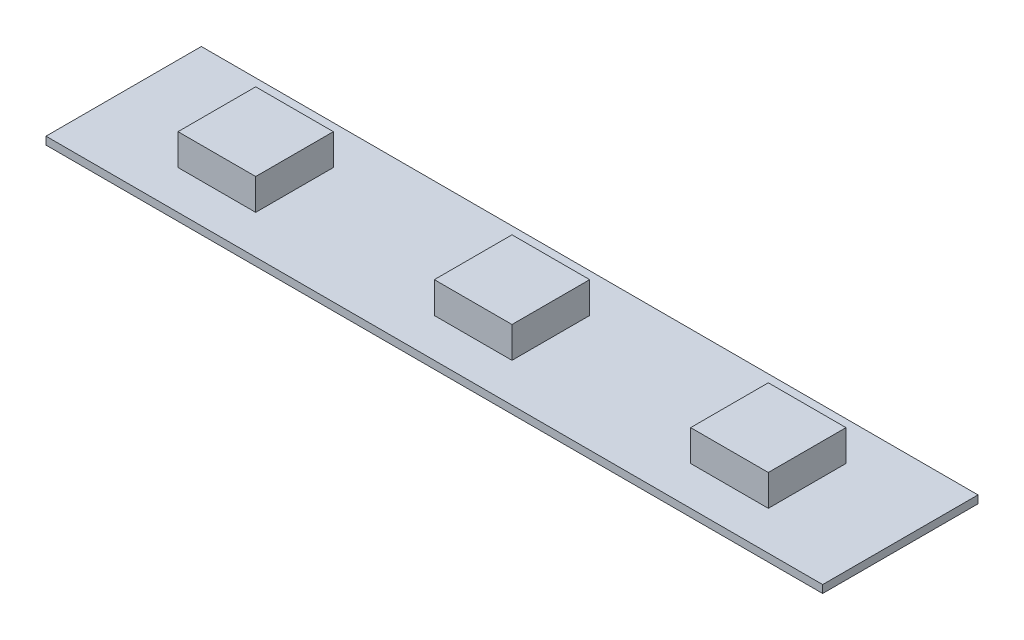
ISO-10303-21;
HEADER;
FILE_DESCRIPTION(('STEP AP214'),'2;1');
FILE_NAME('part.step','',(''),(''),'','','');
FILE_SCHEMA(('AUTOMOTIVE_DESIGN { 1 0 10303 214 1 1 1 1 }'));
ENDSEC;
DATA;
#1=APPLICATION_CONTEXT('core data for automotive mechanical design processes');
#2=APPLICATION_PROTOCOL_DEFINITION('international standard','automotive_design',2000,#1);
#3=PRODUCT_CONTEXT('',#1,'mechanical');
#4=PRODUCT('Part','Part','',(#3));
#5=PRODUCT_RELATED_PRODUCT_CATEGORY('part','',(#4));
#6=PRODUCT_DEFINITION_FORMATION('','',#4);
#7=PRODUCT_DEFINITION_CONTEXT('part definition',#1,'design');
#8=PRODUCT_DEFINITION('design','',#6,#7);
#9=PRODUCT_DEFINITION_SHAPE('','',#8);
#10=(LENGTH_UNIT() NAMED_UNIT(*) SI_UNIT(.MILLI.,.METRE.));
#11=(NAMED_UNIT(*) PLANE_ANGLE_UNIT() SI_UNIT($,.RADIAN.));
#12=(NAMED_UNIT(*) SI_UNIT($,.STERADIAN.) SOLID_ANGLE_UNIT());
#13=UNCERTAINTY_MEASURE_WITH_UNIT(LENGTH_MEASURE(1.E-05),#10,'distance_accuracy_value','');
#14=(GEOMETRIC_REPRESENTATION_CONTEXT(3) GLOBAL_UNCERTAINTY_ASSIGNED_CONTEXT((#13)) GLOBAL_UNIT_ASSIGNED_CONTEXT((#10,
#11,#12)) REPRESENTATION_CONTEXT('',''));
#15=CARTESIAN_POINT('',(0.,0.,0.));
#16=DIRECTION('',(0.,0.,1.));
#17=DIRECTION('',(1.,0.,0.));
#18=AXIS2_PLACEMENT_3D('',#15,#16,#17);
#19=CARTESIAN_POINT('',(0.,0.5,0.));
#20=DIRECTION('',(0.,-1.,0.));
#21=DIRECTION('',(0.,0.,-1.));
#22=AXIS2_PLACEMENT_3D('',#19,#20,#21);
#23=PLANE('',#22);
#24=DIRECTION('',(0.,0.,-1.));
#25=VECTOR('',#24,1.);
#26=CARTESIAN_POINT('',(2.5,0.5,2.5));
#27=LINE('',#26,#25);
#28=CARTESIAN_POINT('',(2.5,0.5,2.5));
#29=VERTEX_POINT('',#28);
#30=CARTESIAN_POINT('',(2.5,0.5,-2.5));
#31=VERTEX_POINT('',#30);
#32=EDGE_CURVE('E180',#29,#31,#27,.T.);
#33=ORIENTED_EDGE('',*,*,#32,.F.);
#34=DIRECTION('',(1.,0.,0.));
#35=VECTOR('',#34,1.);
#36=CARTESIAN_POINT('',(-2.5,0.5,2.5));
#37=LINE('',#36,#35);
#38=CARTESIAN_POINT('',(-2.5,0.5,2.5));
#39=VERTEX_POINT('',#38);
#40=EDGE_CURVE('E196',#39,#29,#37,.T.);
#41=ORIENTED_EDGE('',*,*,#40,.F.);
#42=DIRECTION('',(0.,0.,1.));
#43=VECTOR('',#42,1.);
#44=CARTESIAN_POINT('',(-2.5,0.5,2.5));
#45=LINE('',#44,#43);
#46=CARTESIAN_POINT('',(-2.5,0.5,-2.5));
#47=VERTEX_POINT('',#46);
#48=EDGE_CURVE('E209',#47,#39,#45,.T.);
#49=ORIENTED_EDGE('',*,*,#48,.F.);
#50=DIRECTION('',(-1.,0.,0.));
#51=VECTOR('',#50,1.);
#52=CARTESIAN_POINT('',(-2.5,0.5,-2.5));
#53=LINE('',#52,#51);
#54=EDGE_CURVE('E185',#31,#47,#53,.T.);
#55=ORIENTED_EDGE('',*,*,#54,.F.);
#56=EDGE_LOOP('',(#33,#41,#49,#55));
#57=FACE_BOUND('',#56,.T.);
#58=DIRECTION('',(0.,0.,-1.));
#59=VECTOR('',#58,1.);
#60=CARTESIAN_POINT('',(25.,0.5,5.));
#61=LINE('',#60,#59);
#62=CARTESIAN_POINT('',(25.,0.5,5.));
#63=VERTEX_POINT('',#62);
#64=CARTESIAN_POINT('',(25.,0.5,-5.));
#65=VERTEX_POINT('',#64);
#66=EDGE_CURVE('E277',#63,#65,#61,.T.);
#67=ORIENTED_EDGE('',*,*,#66,.T.);
#68=DIRECTION('',(-1.,0.,0.));
#69=VECTOR('',#68,1.);
#70=CARTESIAN_POINT('',(-25.,0.5,-5.));
#71=LINE('',#70,#69);
#72=CARTESIAN_POINT('',(-25.,0.5,-5.));
#73=VERTEX_POINT('',#72);
#74=EDGE_CURVE('E281',#65,#73,#71,.T.);
#75=ORIENTED_EDGE('',*,*,#74,.T.);
#76=DIRECTION('',(0.,0.,1.));
#77=VECTOR('',#76,1.);
#78=CARTESIAN_POINT('',(-25.,0.5,5.));
#79=LINE('',#78,#77);
#80=CARTESIAN_POINT('',(-25.,0.5,5.));
#81=VERTEX_POINT('',#80);
#82=EDGE_CURVE('E285',#73,#81,#79,.T.);
#83=ORIENTED_EDGE('',*,*,#82,.T.);
#84=DIRECTION('',(1.,0.,0.));
#85=VECTOR('',#84,1.);
#86=CARTESIAN_POINT('',(-25.,0.5,5.));
#87=LINE('',#86,#85);
#88=EDGE_CURVE('E288',#81,#63,#87,.T.);
#89=ORIENTED_EDGE('',*,*,#88,.T.);
#90=EDGE_LOOP('',(#67,#75,#83,#89));
#91=FACE_BOUND('',#90,.T.);
#92=DIRECTION('',(0.,0.,-1.));
#93=VECTOR('',#92,1.);
#94=CARTESIAN_POINT('',(-14.0006382669834,0.5,2.5));
#95=LINE('',#94,#93);
#96=CARTESIAN_POINT('',(-14.0006382669834,0.5,2.5));
#97=VERTEX_POINT('',#96);
#98=CARTESIAN_POINT('',(-14.0006382669834,0.5,-2.5));
#99=VERTEX_POINT('',#98);
#100=EDGE_CURVE('E231',#97,#99,#95,.T.);
#101=ORIENTED_EDGE('',*,*,#100,.F.);
#102=DIRECTION('',(1.,0.,0.));
#103=VECTOR('',#102,1.);
#104=CARTESIAN_POINT('',(-19.0006382669834,0.5,2.5));
#105=LINE('',#104,#103);
#106=CARTESIAN_POINT('',(-19.0006382669834,0.5,2.5));
#107=VERTEX_POINT('',#106);
#108=EDGE_CURVE('E237',#107,#97,#105,.T.);
#109=ORIENTED_EDGE('',*,*,#108,.F.);
#110=DIRECTION('',(0.,0.,1.));
#111=VECTOR('',#110,1.);
#112=CARTESIAN_POINT('',(-19.0006382669834,0.5,2.5));
#113=LINE('',#112,#111);
#114=CARTESIAN_POINT('',(-19.0006382669834,0.5,-2.5));
#115=VERTEX_POINT('',#114);
#116=EDGE_CURVE('E254',#115,#107,#113,.T.);
#117=ORIENTED_EDGE('',*,*,#116,.F.);
#118=DIRECTION('',(-1.,0.,0.));
#119=VECTOR('',#118,1.);
#120=CARTESIAN_POINT('',(-19.0006382669834,0.5,-2.5));
#121=LINE('',#120,#119);
#122=EDGE_CURVE('E250',#99,#115,#121,.T.);
#123=ORIENTED_EDGE('',*,*,#122,.F.);
#124=EDGE_LOOP('',(#101,#109,#117,#123));
#125=FACE_BOUND('',#124,.T.);
#126=DIRECTION('',(0.,0.,1.));
#127=VECTOR('',#126,1.);
#128=CARTESIAN_POINT('',(14.0006382669833,0.5,2.5));
#129=LINE('',#128,#127);
#130=CARTESIAN_POINT('',(14.0006382669833,0.5,-2.5));
#131=VERTEX_POINT('',#130);
#132=CARTESIAN_POINT('',(14.0006382669833,0.5,2.5));
#133=VERTEX_POINT('',#132);
#134=EDGE_CURVE('E178',#131,#133,#129,.T.);
#135=ORIENTED_EDGE('',*,*,#134,.F.);
#136=DIRECTION('',(-1.,0.,0.));
#137=VECTOR('',#136,1.);
#138=CARTESIAN_POINT('',(19.0006382669833,0.5,-2.5));
#139=LINE('',#138,#137);
#140=CARTESIAN_POINT('',(19.0006382669833,0.5,-2.5));
#141=VERTEX_POINT('',#140);
#142=EDGE_CURVE('E175',#141,#131,#139,.T.);
#143=ORIENTED_EDGE('',*,*,#142,.F.);
#144=DIRECTION('',(0.,0.,-1.));
#145=VECTOR('',#144,1.);
#146=CARTESIAN_POINT('',(19.0006382669833,0.5,2.5));
#147=LINE('',#146,#145);
#148=CARTESIAN_POINT('',(19.0006382669833,0.5,2.5));
#149=VERTEX_POINT('',#148);
#150=EDGE_CURVE('E63',#149,#141,#147,.T.);
#151=ORIENTED_EDGE('',*,*,#150,.F.);
#152=DIRECTION('',(1.,0.,0.));
#153=VECTOR('',#152,1.);
#154=CARTESIAN_POINT('',(19.0006382669833,0.5,2.5));
#155=LINE('',#154,#153);
#156=EDGE_CURVE('E58',#133,#149,#155,.T.);
#157=ORIENTED_EDGE('',*,*,#156,.F.);
#158=EDGE_LOOP('',(#135,#143,#151,#157));
#159=FACE_BOUND('',#158,.T.);
#160=ADVANCED_FACE('F42',(#57,#91,#125,#159),#23,.F.);
#161=CARTESIAN_POINT('',(25.,0.5,5.));
#162=DIRECTION('',(-1.,0.,0.));
#163=DIRECTION('',(0.,0.,1.));
#164=AXIS2_PLACEMENT_3D('',#161,#162,#163);
#165=PLANE('',#164);
#166=DIRECTION('',(0.,0.,-1.));
#167=VECTOR('',#166,1.);
#168=CARTESIAN_POINT('',(25.,0.,5.));
#169=LINE('',#168,#167);
#170=CARTESIAN_POINT('',(25.,0.,5.));
#171=VERTEX_POINT('',#170);
#172=CARTESIAN_POINT('',(25.,0.,-5.));
#173=VERTEX_POINT('',#172);
#174=EDGE_CURVE('E276',#171,#173,#169,.T.);
#175=ORIENTED_EDGE('',*,*,#174,.T.);
#176=DIRECTION('',(0.,-1.,0.));
#177=VECTOR('',#176,1.);
#178=CARTESIAN_POINT('',(25.,0.5,-5.));
#179=LINE('',#178,#177);
#180=EDGE_CURVE('E11',#65,#173,#179,.T.);
#181=ORIENTED_EDGE('',*,*,#180,.F.);
#182=ORIENTED_EDGE('',*,*,#66,.F.);
#183=DIRECTION('',(0.,-1.,0.));
#184=VECTOR('',#183,1.);
#185=CARTESIAN_POINT('',(25.,0.5,5.));
#186=LINE('',#185,#184);
#187=EDGE_CURVE('E291',#63,#171,#186,.T.);
#188=ORIENTED_EDGE('',*,*,#187,.T.);
#189=EDGE_LOOP('',(#175,#181,#182,#188));
#190=FACE_BOUND('',#189,.T.);
#191=ADVANCED_FACE('F44',(#190),#165,.F.);
#192=CARTESIAN_POINT('',(-25.,0.5,-5.));
#193=DIRECTION('',(0.,0.,1.));
#194=DIRECTION('',(1.,0.,0.));
#195=AXIS2_PLACEMENT_3D('',#192,#193,#194);
#196=PLANE('',#195);
#197=DIRECTION('',(-1.,0.,0.));
#198=VECTOR('',#197,1.);
#199=CARTESIAN_POINT('',(-25.,0.,-5.));
#200=LINE('',#199,#198);
#201=CARTESIAN_POINT('',(-25.,0.,-5.));
#202=VERTEX_POINT('',#201);
#203=EDGE_CURVE('E295',#173,#202,#200,.T.);
#204=ORIENTED_EDGE('',*,*,#203,.T.);
#205=DIRECTION('',(0.,-1.,0.));
#206=VECTOR('',#205,1.);
#207=CARTESIAN_POINT('',(-25.,0.5,-5.));
#208=LINE('',#207,#206);
#209=EDGE_CURVE('E51',#73,#202,#208,.T.);
#210=ORIENTED_EDGE('',*,*,#209,.F.);
#211=ORIENTED_EDGE('',*,*,#74,.F.);
#212=ORIENTED_EDGE('',*,*,#180,.T.);
#213=EDGE_LOOP('',(#204,#210,#211,#212));
#214=FACE_BOUND('',#213,.T.);
#215=ADVANCED_FACE('F331',(#214),#196,.F.);
#216=CARTESIAN_POINT('',(-25.,0.5,5.));
#217=DIRECTION('',(1.,0.,0.));
#218=DIRECTION('',(0.,0.,-1.));
#219=AXIS2_PLACEMENT_3D('',#216,#217,#218);
#220=PLANE('',#219);
#221=DIRECTION('',(0.,0.,1.));
#222=VECTOR('',#221,1.);
#223=CARTESIAN_POINT('',(-25.,0.,5.));
#224=LINE('',#223,#222);
#225=CARTESIAN_POINT('',(-25.,0.,5.));
#226=VERTEX_POINT('',#225);
#227=EDGE_CURVE('E298',#202,#226,#224,.T.);
#228=ORIENTED_EDGE('',*,*,#227,.T.);
#229=DIRECTION('',(0.,-1.,0.));
#230=VECTOR('',#229,1.);
#231=CARTESIAN_POINT('',(-25.,0.5,5.));
#232=LINE('',#231,#230);
#233=EDGE_CURVE('E306',#81,#226,#232,.T.);
#234=ORIENTED_EDGE('',*,*,#233,.F.);
#235=ORIENTED_EDGE('',*,*,#82,.F.);
#236=ORIENTED_EDGE('',*,*,#209,.T.);
#237=EDGE_LOOP('',(#228,#234,#235,#236));
#238=FACE_BOUND('',#237,.T.);
#239=ADVANCED_FACE('F315',(#238),#220,.F.);
#240=CARTESIAN_POINT('',(-25.,0.5,5.));
#241=DIRECTION('',(0.,0.,-1.));
#242=DIRECTION('',(-1.,0.,0.));
#243=AXIS2_PLACEMENT_3D('',#240,#241,#242);
#244=PLANE('',#243);
#245=DIRECTION('',(1.,0.,0.));
#246=VECTOR('',#245,1.);
#247=CARTESIAN_POINT('',(-25.,0.,5.));
#248=LINE('',#247,#246);
#249=EDGE_CURVE('E282',#226,#171,#248,.T.);
#250=ORIENTED_EDGE('',*,*,#249,.T.);
#251=ORIENTED_EDGE('',*,*,#187,.F.);
#252=ORIENTED_EDGE('',*,*,#88,.F.);
#253=ORIENTED_EDGE('',*,*,#233,.T.);
#254=EDGE_LOOP('',(#250,#251,#252,#253));
#255=FACE_BOUND('',#254,.T.);
#256=ADVANCED_FACE('F324',(#255),#244,.F.);
#257=CARTESIAN_POINT('',(0.,0.,0.));
#258=DIRECTION('',(0.,-1.,0.));
#259=DIRECTION('',(0.,0.,-1.));
#260=AXIS2_PLACEMENT_3D('',#257,#258,#259);
#261=PLANE('',#260);
#262=ORIENTED_EDGE('',*,*,#174,.F.);
#263=ORIENTED_EDGE('',*,*,#249,.F.);
#264=ORIENTED_EDGE('',*,*,#227,.F.);
#265=ORIENTED_EDGE('',*,*,#203,.F.);
#266=EDGE_LOOP('',(#262,#263,#264,#265));
#267=FACE_BOUND('',#266,.T.);
#268=ADVANCED_FACE('F321',(#267),#261,.T.);
#269=CARTESIAN_POINT('',(-14.0006382669834,2.5,2.5));
#270=DIRECTION('',(-1.,0.,0.));
#271=DIRECTION('',(0.,0.,1.));
#272=AXIS2_PLACEMENT_3D('',#269,#270,#271);
#273=PLANE('',#272);
#274=ORIENTED_EDGE('',*,*,#100,.T.);
#275=DIRECTION('',(0.,-1.,0.));
#276=VECTOR('',#275,1.);
#277=CARTESIAN_POINT('',(-14.0006382669834,2.5,-2.5));
#278=LINE('',#277,#276);
#279=CARTESIAN_POINT('',(-14.0006382669834,2.5,-2.5));
#280=VERTEX_POINT('',#279);
#281=EDGE_CURVE('E272',#280,#99,#278,.T.);
#282=ORIENTED_EDGE('',*,*,#281,.F.);
#283=DIRECTION('',(0.,0.,-1.));
#284=VECTOR('',#283,1.);
#285=CARTESIAN_POINT('',(-14.0006382669834,2.5,2.5));
#286=LINE('',#285,#284);
#287=CARTESIAN_POINT('',(-14.0006382669834,2.5,2.5));
#288=VERTEX_POINT('',#287);
#289=EDGE_CURVE('E232',#288,#280,#286,.T.);
#290=ORIENTED_EDGE('',*,*,#289,.F.);
#291=DIRECTION('',(0.,-1.,0.));
#292=VECTOR('',#291,1.);
#293=CARTESIAN_POINT('',(-14.0006382669834,2.5,2.5));
#294=LINE('',#293,#292);
#295=EDGE_CURVE('E246',#288,#97,#294,.T.);
#296=ORIENTED_EDGE('',*,*,#295,.T.);
#297=EDGE_LOOP('',(#274,#282,#290,#296));
#298=FACE_BOUND('',#297,.T.);
#299=ADVANCED_FACE('F345',(#298),#273,.F.);
#300=CARTESIAN_POINT('',(-19.0006382669834,2.5,-2.5));
#301=DIRECTION('',(0.,0.,1.));
#302=DIRECTION('',(1.,0.,0.));
#303=AXIS2_PLACEMENT_3D('',#300,#301,#302);
#304=PLANE('',#303);
#305=ORIENTED_EDGE('',*,*,#122,.T.);
#306=DIRECTION('',(0.,-1.,0.));
#307=VECTOR('',#306,1.);
#308=CARTESIAN_POINT('',(-19.0006382669834,2.5,-2.5));
#309=LINE('',#308,#307);
#310=CARTESIAN_POINT('',(-19.0006382669834,2.5,-2.5));
#311=VERTEX_POINT('',#310);
#312=EDGE_CURVE('E268',#311,#115,#309,.T.);
#313=ORIENTED_EDGE('',*,*,#312,.F.);
#314=DIRECTION('',(-1.,0.,0.));
#315=VECTOR('',#314,1.);
#316=CARTESIAN_POINT('',(-19.0006382669834,2.5,-2.5));
#317=LINE('',#316,#315);
#318=EDGE_CURVE('E236',#280,#311,#317,.T.);
#319=ORIENTED_EDGE('',*,*,#318,.F.);
#320=ORIENTED_EDGE('',*,*,#281,.T.);
#321=EDGE_LOOP('',(#305,#313,#319,#320));
#322=FACE_BOUND('',#321,.T.);
#323=ADVANCED_FACE('F364',(#322),#304,.F.);
#324=CARTESIAN_POINT('',(-19.0006382669834,2.5,2.5));
#325=DIRECTION('',(1.,0.,0.));
#326=DIRECTION('',(0.,0.,-1.));
#327=AXIS2_PLACEMENT_3D('',#324,#325,#326);
#328=PLANE('',#327);
#329=ORIENTED_EDGE('',*,*,#116,.T.);
#330=DIRECTION('',(0.,-1.,0.));
#331=VECTOR('',#330,1.);
#332=CARTESIAN_POINT('',(-19.0006382669834,2.5,2.5));
#333=LINE('',#332,#331);
#334=CARTESIAN_POINT('',(-19.0006382669834,2.5,2.5));
#335=VERTEX_POINT('',#334);
#336=EDGE_CURVE('E264',#335,#107,#333,.T.);
#337=ORIENTED_EDGE('',*,*,#336,.F.);
#338=DIRECTION('',(0.,0.,1.));
#339=VECTOR('',#338,1.);
#340=CARTESIAN_POINT('',(-19.0006382669834,2.5,2.5));
#341=LINE('',#340,#339);
#342=EDGE_CURVE('E240',#311,#335,#341,.T.);
#343=ORIENTED_EDGE('',*,*,#342,.F.);
#344=ORIENTED_EDGE('',*,*,#312,.T.);
#345=EDGE_LOOP('',(#329,#337,#343,#344));
#346=FACE_BOUND('',#345,.T.);
#347=ADVANCED_FACE('F371',(#346),#328,.F.);
#348=CARTESIAN_POINT('',(-19.0006382669834,2.5,2.5));
#349=DIRECTION('',(0.,0.,-1.));
#350=DIRECTION('',(-1.,0.,0.));
#351=AXIS2_PLACEMENT_3D('',#348,#349,#350);
#352=PLANE('',#351);
#353=ORIENTED_EDGE('',*,*,#108,.T.);
#354=ORIENTED_EDGE('',*,*,#295,.F.);
#355=DIRECTION('',(1.,0.,0.));
#356=VECTOR('',#355,1.);
#357=CARTESIAN_POINT('',(-19.0006382669834,2.5,2.5));
#358=LINE('',#357,#356);
#359=EDGE_CURVE('E243',#335,#288,#358,.T.);
#360=ORIENTED_EDGE('',*,*,#359,.F.);
#361=ORIENTED_EDGE('',*,*,#336,.T.);
#362=EDGE_LOOP('',(#353,#354,#360,#361));
#363=FACE_BOUND('',#362,.T.);
#364=ADVANCED_FACE('F378',(#363),#352,.F.);
#365=CARTESIAN_POINT('',(0.,2.5,0.));
#366=DIRECTION('',(0.,-1.,0.));
#367=DIRECTION('',(0.,0.,-1.));
#368=AXIS2_PLACEMENT_3D('',#365,#366,#367);
#369=PLANE('',#368);
#370=ORIENTED_EDGE('',*,*,#289,.T.);
#371=ORIENTED_EDGE('',*,*,#318,.T.);
#372=ORIENTED_EDGE('',*,*,#342,.T.);
#373=ORIENTED_EDGE('',*,*,#359,.T.);
#374=EDGE_LOOP('',(#370,#371,#372,#373));
#375=FACE_BOUND('',#374,.T.);
#376=ADVANCED_FACE('F386',(#375),#369,.F.);
#377=CARTESIAN_POINT('',(2.5,2.5,2.5));
#378=DIRECTION('',(-1.,0.,0.));
#379=DIRECTION('',(0.,0.,1.));
#380=AXIS2_PLACEMENT_3D('',#377,#378,#379);
#381=PLANE('',#380);
#382=ORIENTED_EDGE('',*,*,#32,.T.);
#383=DIRECTION('',(0.,-1.,0.));
#384=VECTOR('',#383,1.);
#385=CARTESIAN_POINT('',(2.5,2.5,-2.5));
#386=LINE('',#385,#384);
#387=CARTESIAN_POINT('',(2.5,2.5,-2.5));
#388=VERTEX_POINT('',#387);
#389=EDGE_CURVE('E227',#388,#31,#386,.T.);
#390=ORIENTED_EDGE('',*,*,#389,.F.);
#391=DIRECTION('',(0.,0.,-1.));
#392=VECTOR('',#391,1.);
#393=CARTESIAN_POINT('',(2.5,2.5,2.5));
#394=LINE('',#393,#392);
#395=CARTESIAN_POINT('',(2.5,2.5,2.5));
#396=VERTEX_POINT('',#395);
#397=EDGE_CURVE('E191',#396,#388,#394,.T.);
#398=ORIENTED_EDGE('',*,*,#397,.F.);
#399=DIRECTION('',(0.,-1.,0.));
#400=VECTOR('',#399,1.);
#401=CARTESIAN_POINT('',(2.5,2.5,2.5));
#402=LINE('',#401,#400);
#403=EDGE_CURVE('E204',#396,#29,#402,.T.);
#404=ORIENTED_EDGE('',*,*,#403,.T.);
#405=EDGE_LOOP('',(#382,#390,#398,#404));
#406=FACE_BOUND('',#405,.T.);
#407=ADVANCED_FACE('F394',(#406),#381,.F.);
#408=CARTESIAN_POINT('',(-2.5,2.5,-2.5));
#409=DIRECTION('',(0.,0.,1.));
#410=DIRECTION('',(1.,0.,0.));
#411=AXIS2_PLACEMENT_3D('',#408,#409,#410);
#412=PLANE('',#411);
#413=ORIENTED_EDGE('',*,*,#54,.T.);
#414=DIRECTION('',(0.,-1.,0.));
#415=VECTOR('',#414,1.);
#416=CARTESIAN_POINT('',(-2.5,2.5,-2.5));
#417=LINE('',#416,#415);
#418=CARTESIAN_POINT('',(-2.5,2.5,-2.5));
#419=VERTEX_POINT('',#418);
#420=EDGE_CURVE('E223',#419,#47,#417,.T.);
#421=ORIENTED_EDGE('',*,*,#420,.F.);
#422=DIRECTION('',(-1.,0.,0.));
#423=VECTOR('',#422,1.);
#424=CARTESIAN_POINT('',(-2.5,2.5,-2.5));
#425=LINE('',#424,#423);
#426=EDGE_CURVE('E195',#388,#419,#425,.T.);
#427=ORIENTED_EDGE('',*,*,#426,.F.);
#428=ORIENTED_EDGE('',*,*,#389,.T.);
#429=EDGE_LOOP('',(#413,#421,#427,#428));
#430=FACE_BOUND('',#429,.T.);
#431=ADVANCED_FACE('F402',(#430),#412,.F.);
#432=CARTESIAN_POINT('',(-2.5,2.5,2.5));
#433=DIRECTION('',(1.,0.,0.));
#434=DIRECTION('',(0.,0.,-1.));
#435=AXIS2_PLACEMENT_3D('',#432,#433,#434);
#436=PLANE('',#435);
#437=ORIENTED_EDGE('',*,*,#48,.T.);
#438=DIRECTION('',(0.,-1.,0.));
#439=VECTOR('',#438,1.);
#440=CARTESIAN_POINT('',(-2.5,2.5,2.5));
#441=LINE('',#440,#439);
#442=CARTESIAN_POINT('',(-2.5,2.5,2.5));
#443=VERTEX_POINT('',#442);
#444=EDGE_CURVE('E219',#443,#39,#441,.T.);
#445=ORIENTED_EDGE('',*,*,#444,.F.);
#446=DIRECTION('',(0.,0.,1.));
#447=VECTOR('',#446,1.);
#448=CARTESIAN_POINT('',(-2.5,2.5,2.5));
#449=LINE('',#448,#447);
#450=EDGE_CURVE('E199',#419,#443,#449,.T.);
#451=ORIENTED_EDGE('',*,*,#450,.F.);
#452=ORIENTED_EDGE('',*,*,#420,.T.);
#453=EDGE_LOOP('',(#437,#445,#451,#452));
#454=FACE_BOUND('',#453,.T.);
#455=ADVANCED_FACE('F410',(#454),#436,.F.);
#456=CARTESIAN_POINT('',(-2.5,2.5,2.5));
#457=DIRECTION('',(0.,0.,-1.));
#458=DIRECTION('',(-1.,0.,0.));
#459=AXIS2_PLACEMENT_3D('',#456,#457,#458);
#460=PLANE('',#459);
#461=ORIENTED_EDGE('',*,*,#40,.T.);
#462=ORIENTED_EDGE('',*,*,#403,.F.);
#463=DIRECTION('',(1.,0.,0.));
#464=VECTOR('',#463,1.);
#465=CARTESIAN_POINT('',(-2.5,2.5,2.5));
#466=LINE('',#465,#464);
#467=EDGE_CURVE('E202',#443,#396,#466,.T.);
#468=ORIENTED_EDGE('',*,*,#467,.F.);
#469=ORIENTED_EDGE('',*,*,#444,.T.);
#470=EDGE_LOOP('',(#461,#462,#468,#469));
#471=FACE_BOUND('',#470,.T.);
#472=ADVANCED_FACE('F418',(#471),#460,.F.);
#473=CARTESIAN_POINT('',(0.,2.5,0.));
#474=DIRECTION('',(0.,-1.,0.));
#475=DIRECTION('',(0.,0.,-1.));
#476=AXIS2_PLACEMENT_3D('',#473,#474,#475);
#477=PLANE('',#476);
#478=ORIENTED_EDGE('',*,*,#397,.T.);
#479=ORIENTED_EDGE('',*,*,#426,.T.);
#480=ORIENTED_EDGE('',*,*,#450,.T.);
#481=ORIENTED_EDGE('',*,*,#467,.T.);
#482=EDGE_LOOP('',(#478,#479,#480,#481));
#483=FACE_BOUND('',#482,.T.);
#484=ADVANCED_FACE('F426',(#483),#477,.F.);
#485=CARTESIAN_POINT('',(14.0006382669833,2.5,2.5));
#486=DIRECTION('',(1.,0.,0.));
#487=DIRECTION('',(0.,0.,-1.));
#488=AXIS2_PLACEMENT_3D('',#485,#486,#487);
#489=PLANE('',#488);
#490=ORIENTED_EDGE('',*,*,#134,.T.);
#491=DIRECTION('',(0.,-1.,0.));
#492=VECTOR('',#491,1.);
#493=CARTESIAN_POINT('',(14.0006382669833,2.5,2.5));
#494=LINE('',#493,#492);
#495=CARTESIAN_POINT('',(14.0006382669833,2.5,2.5));
#496=VERTEX_POINT('',#495);
#497=EDGE_CURVE('E157',#496,#133,#494,.T.);
#498=ORIENTED_EDGE('',*,*,#497,.F.);
#499=DIRECTION('',(0.,0.,1.));
#500=VECTOR('',#499,1.);
#501=CARTESIAN_POINT('',(14.0006382669833,2.5,2.5));
#502=LINE('',#501,#500);
#503=CARTESIAN_POINT('',(14.0006382669833,2.5,-2.5));
#504=VERTEX_POINT('',#503);
#505=EDGE_CURVE('E165',#504,#496,#502,.T.);
#506=ORIENTED_EDGE('',*,*,#505,.F.);
#507=DIRECTION('',(0.,-1.,0.));
#508=VECTOR('',#507,1.);
#509=CARTESIAN_POINT('',(14.0006382669833,2.5,-2.5));
#510=LINE('',#509,#508);
#511=EDGE_CURVE('E567',#504,#131,#510,.T.);
#512=ORIENTED_EDGE('',*,*,#511,.T.);
#513=EDGE_LOOP('',(#490,#498,#506,#512));
#514=FACE_BOUND('',#513,.T.);
#515=ADVANCED_FACE('F177',(#514),#489,.F.);
#516=CARTESIAN_POINT('',(19.0006382669833,2.5,2.5));
#517=DIRECTION('',(0.,0.,-1.));
#518=DIRECTION('',(-1.,0.,0.));
#519=AXIS2_PLACEMENT_3D('',#516,#517,#518);
#520=PLANE('',#519);
#521=ORIENTED_EDGE('',*,*,#156,.T.);
#522=DIRECTION('',(0.,-1.,0.));
#523=VECTOR('',#522,1.);
#524=CARTESIAN_POINT('',(19.0006382669833,2.5,2.5));
#525=LINE('',#524,#523);
#526=CARTESIAN_POINT('',(19.0006382669833,2.5,2.5));
#527=VERTEX_POINT('',#526);
#528=EDGE_CURVE('E160',#527,#149,#525,.T.);
#529=ORIENTED_EDGE('',*,*,#528,.F.);
#530=DIRECTION('',(1.,0.,0.));
#531=VECTOR('',#530,1.);
#532=CARTESIAN_POINT('',(19.0006382669833,2.5,2.5));
#533=LINE('',#532,#531);
#534=EDGE_CURVE('E153',#496,#527,#533,.T.);
#535=ORIENTED_EDGE('',*,*,#534,.F.);
#536=ORIENTED_EDGE('',*,*,#497,.T.);
#537=EDGE_LOOP('',(#521,#529,#535,#536));
#538=FACE_BOUND('',#537,.T.);
#539=ADVANCED_FACE('F155',(#538),#520,.F.);
#540=CARTESIAN_POINT('',(19.0006382669833,2.5,2.5));
#541=DIRECTION('',(-1.,0.,0.));
#542=DIRECTION('',(0.,0.,1.));
#543=AXIS2_PLACEMENT_3D('',#540,#541,#542);
#544=PLANE('',#543);
#545=ORIENTED_EDGE('',*,*,#150,.T.);
#546=DIRECTION('',(0.,-1.,0.));
#547=VECTOR('',#546,1.);
#548=CARTESIAN_POINT('',(19.0006382669833,2.5,-2.5));
#549=LINE('',#548,#547);
#550=CARTESIAN_POINT('',(19.0006382669833,2.5,-2.5));
#551=VERTEX_POINT('',#550);
#552=EDGE_CURVE('E187',#551,#141,#549,.T.);
#553=ORIENTED_EDGE('',*,*,#552,.F.);
#554=DIRECTION('',(0.,0.,-1.));
#555=VECTOR('',#554,1.);
#556=CARTESIAN_POINT('',(19.0006382669833,2.5,2.5));
#557=LINE('',#556,#555);
#558=EDGE_CURVE('E164',#527,#551,#557,.T.);
#559=ORIENTED_EDGE('',*,*,#558,.F.);
#560=ORIENTED_EDGE('',*,*,#528,.T.);
#561=EDGE_LOOP('',(#545,#553,#559,#560));
#562=FACE_BOUND('',#561,.T.);
#563=ADVANCED_FACE('F447',(#562),#544,.F.);
#564=CARTESIAN_POINT('',(19.0006382669833,2.5,-2.5));
#565=DIRECTION('',(0.,0.,1.));
#566=DIRECTION('',(1.,0.,0.));
#567=AXIS2_PLACEMENT_3D('',#564,#565,#566);
#568=PLANE('',#567);
#569=ORIENTED_EDGE('',*,*,#142,.T.);
#570=ORIENTED_EDGE('',*,*,#511,.F.);
#571=DIRECTION('',(-1.,0.,0.));
#572=VECTOR('',#571,1.);
#573=CARTESIAN_POINT('',(19.0006382669833,2.5,-2.5));
#574=LINE('',#573,#572);
#575=EDGE_CURVE('E170',#551,#504,#574,.T.);
#576=ORIENTED_EDGE('',*,*,#575,.F.);
#577=ORIENTED_EDGE('',*,*,#552,.T.);
#578=EDGE_LOOP('',(#569,#570,#576,#577));
#579=FACE_BOUND('',#578,.T.);
#580=ADVANCED_FACE('F454',(#579),#568,.F.);
#581=CARTESIAN_POINT('',(0.,2.5,0.));
#582=DIRECTION('',(0.,1.,0.));
#583=DIRECTION('',(0.,0.,1.));
#584=AXIS2_PLACEMENT_3D('',#581,#582,#583);
#585=PLANE('',#584);
#586=ORIENTED_EDGE('',*,*,#505,.T.);
#587=ORIENTED_EDGE('',*,*,#534,.T.);
#588=ORIENTED_EDGE('',*,*,#558,.T.);
#589=ORIENTED_EDGE('',*,*,#575,.T.);
#590=EDGE_LOOP('',(#586,#587,#588,#589));
#591=FACE_BOUND('',#590,.T.);
#592=ADVANCED_FACE('F168',(#591),#585,.T.);
#593=CLOSED_SHELL('',(#160,#191,#215,#239,#256,#268,#299,#323,#347,#364,#376,#407,#431,#455,
#472,#484,#515,#539,#563,#580,#592));
#594=MANIFOLD_SOLID_BREP('B2',#593);
#595=ADVANCED_BREP_SHAPE_REPRESENTATION('',(#18,#594),#14);
#596=SHAPE_DEFINITION_REPRESENTATION(#9,#595);
ENDSEC;
END-ISO-10303-21;
